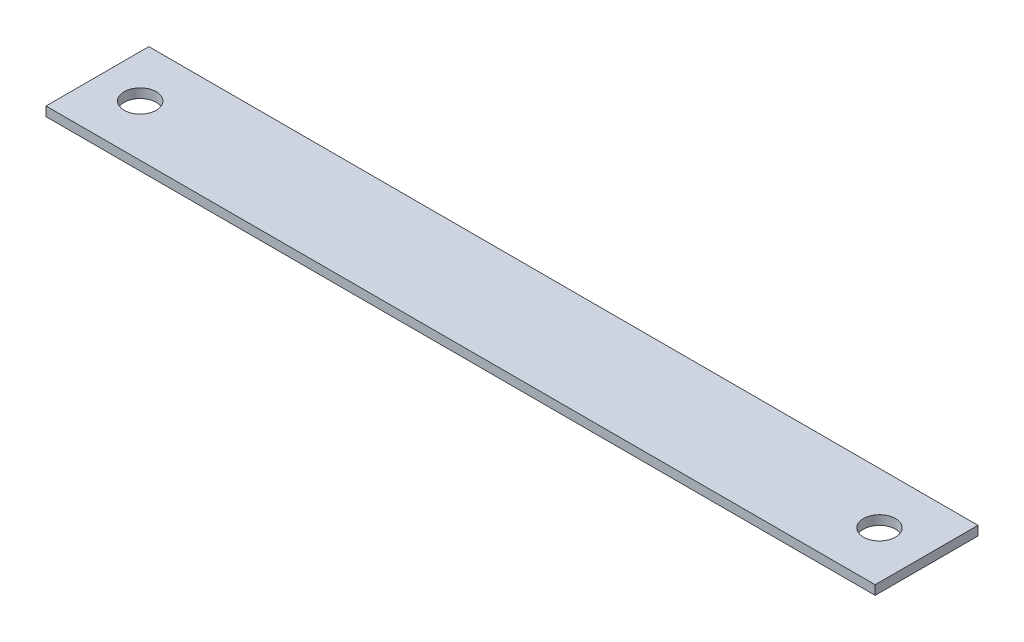
ISO-10303-21;
HEADER;
FILE_DESCRIPTION(('STEP AP214'),'2;1');
FILE_NAME('part.step','',(''),(''),'','','');
FILE_SCHEMA(('AUTOMOTIVE_DESIGN { 1 0 10303 214 1 1 1 1 }'));
ENDSEC;
DATA;
#1=APPLICATION_CONTEXT('core data for automotive mechanical design processes');
#2=APPLICATION_PROTOCOL_DEFINITION('international standard','automotive_design',2000,#1);
#3=PRODUCT_CONTEXT('',#1,'mechanical');
#4=PRODUCT('Part','Part','',(#3));
#5=PRODUCT_RELATED_PRODUCT_CATEGORY('part','',(#4));
#6=PRODUCT_DEFINITION_FORMATION('','',#4);
#7=PRODUCT_DEFINITION_CONTEXT('part definition',#1,'design');
#8=PRODUCT_DEFINITION('design','',#6,#7);
#9=PRODUCT_DEFINITION_SHAPE('','',#8);
#10=(LENGTH_UNIT() NAMED_UNIT(*) SI_UNIT(.MILLI.,.METRE.));
#11=(NAMED_UNIT(*) PLANE_ANGLE_UNIT() SI_UNIT($,.RADIAN.));
#12=(NAMED_UNIT(*) SI_UNIT($,.STERADIAN.) SOLID_ANGLE_UNIT());
#13=UNCERTAINTY_MEASURE_WITH_UNIT(LENGTH_MEASURE(1.E-05),#10,'distance_accuracy_value','');
#14=(GEOMETRIC_REPRESENTATION_CONTEXT(3) GLOBAL_UNCERTAINTY_ASSIGNED_CONTEXT((#13)) GLOBAL_UNIT_ASSIGNED_CONTEXT((#10,
#11,#12)) REPRESENTATION_CONTEXT('',''));
#15=CARTESIAN_POINT('',(0.,0.,0.));
#16=DIRECTION('',(0.,0.,1.));
#17=DIRECTION('',(1.,0.,0.));
#18=AXIS2_PLACEMENT_3D('',#15,#16,#17);
#19=CARTESIAN_POINT('',(0.,2.286,0.));
#20=DIRECTION('',(1.,0.,0.));
#21=DIRECTION('',(0.,0.,-1.));
#22=AXIS2_PLACEMENT_3D('',#19,#20,#21);
#23=PLANE('',#22);
#24=DIRECTION('',(0.,0.,1.));
#25=VECTOR('',#24,1.);
#26=CARTESIAN_POINT('',(0.,0.,0.));
#27=LINE('',#26,#25);
#28=CARTESIAN_POINT('',(0.,0.,-25.4));
#29=VERTEX_POINT('',#28);
#30=CARTESIAN_POINT('',(0.,0.,0.));
#31=VERTEX_POINT('',#30);
#32=EDGE_CURVE('E107',#29,#31,#27,.T.);
#33=ORIENTED_EDGE('',*,*,#32,.T.);
#34=DIRECTION('',(0.,-1.,0.));
#35=VECTOR('',#34,1.);
#36=CARTESIAN_POINT('',(0.,2.286,0.));
#37=LINE('',#36,#35);
#38=CARTESIAN_POINT('',(0.,2.286,0.));
#39=VERTEX_POINT('',#38);
#40=EDGE_CURVE('E11',#39,#31,#37,.T.);
#41=ORIENTED_EDGE('',*,*,#40,.F.);
#42=DIRECTION('',(0.,0.,1.));
#43=VECTOR('',#42,1.);
#44=CARTESIAN_POINT('',(0.,2.286,0.));
#45=LINE('',#44,#43);
#46=CARTESIAN_POINT('',(0.,2.286,-25.4));
#47=VERTEX_POINT('',#46);
#48=EDGE_CURVE('E91',#47,#39,#45,.T.);
#49=ORIENTED_EDGE('',*,*,#48,.F.);
#50=DIRECTION('',(0.,-1.,0.));
#51=VECTOR('',#50,1.);
#52=CARTESIAN_POINT('',(0.,2.286,-25.4));
#53=LINE('',#52,#51);
#54=EDGE_CURVE('E103',#47,#29,#53,.T.);
#55=ORIENTED_EDGE('',*,*,#54,.T.);
#56=EDGE_LOOP('',(#33,#41,#49,#55));
#57=FACE_BOUND('',#56,.T.);
#58=ADVANCED_FACE('F39',(#57),#23,.F.);
#59=CARTESIAN_POINT('',(0.,2.286,0.));
#60=DIRECTION('',(0.,0.,-1.));
#61=DIRECTION('',(-1.,0.,0.));
#62=AXIS2_PLACEMENT_3D('',#59,#60,#61);
#63=PLANE('',#62);
#64=DIRECTION('',(1.,0.,0.));
#65=VECTOR('',#64,1.);
#66=CARTESIAN_POINT('',(0.,0.,0.));
#67=LINE('',#66,#65);
#68=CARTESIAN_POINT('',(204.7875,0.,0.));
#69=VERTEX_POINT('',#68);
#70=EDGE_CURVE('E96',#31,#69,#67,.T.);
#71=ORIENTED_EDGE('',*,*,#70,.T.);
#72=DIRECTION('',(0.,-1.,0.));
#73=VECTOR('',#72,1.);
#74=CARTESIAN_POINT('',(204.7875,2.286,0.));
#75=LINE('',#74,#73);
#76=CARTESIAN_POINT('',(204.7875,2.286,0.));
#77=VERTEX_POINT('',#76);
#78=EDGE_CURVE('E48',#77,#69,#75,.T.);
#79=ORIENTED_EDGE('',*,*,#78,.F.);
#80=DIRECTION('',(1.,0.,0.));
#81=VECTOR('',#80,1.);
#82=CARTESIAN_POINT('',(0.,2.286,0.));
#83=LINE('',#82,#81);
#84=EDGE_CURVE('E86',#39,#77,#83,.T.);
#85=ORIENTED_EDGE('',*,*,#84,.F.);
#86=ORIENTED_EDGE('',*,*,#40,.T.);
#87=EDGE_LOOP('',(#71,#79,#85,#86));
#88=FACE_BOUND('',#87,.T.);
#89=ADVANCED_FACE('F95',(#88),#63,.F.);
#90=CARTESIAN_POINT('',(204.7875,2.286,0.));
#91=DIRECTION('',(-1.,0.,0.));
#92=DIRECTION('',(0.,0.,1.));
#93=AXIS2_PLACEMENT_3D('',#90,#91,#92);
#94=PLANE('',#93);
#95=DIRECTION('',(0.,0.,-1.));
#96=VECTOR('',#95,1.);
#97=CARTESIAN_POINT('',(204.7875,0.,0.));
#98=LINE('',#97,#96);
#99=CARTESIAN_POINT('',(204.7875,0.,-25.4));
#100=VERTEX_POINT('',#99);
#101=EDGE_CURVE('E73',#69,#100,#98,.T.);
#102=ORIENTED_EDGE('',*,*,#101,.T.);
#103=DIRECTION('',(0.,-1.,0.));
#104=VECTOR('',#103,1.);
#105=CARTESIAN_POINT('',(204.7875,2.286,-25.4));
#106=LINE('',#105,#104);
#107=CARTESIAN_POINT('',(204.7875,2.286,-25.4));
#108=VERTEX_POINT('',#107);
#109=EDGE_CURVE('E98',#108,#100,#106,.T.);
#110=ORIENTED_EDGE('',*,*,#109,.F.);
#111=DIRECTION('',(0.,0.,-1.));
#112=VECTOR('',#111,1.);
#113=CARTESIAN_POINT('',(204.7875,2.286,0.));
#114=LINE('',#113,#112);
#115=EDGE_CURVE('E89',#77,#108,#114,.T.);
#116=ORIENTED_EDGE('',*,*,#115,.F.);
#117=ORIENTED_EDGE('',*,*,#78,.T.);
#118=EDGE_LOOP('',(#102,#110,#116,#117));
#119=FACE_BOUND('',#118,.T.);
#120=ADVANCED_FACE('F99',(#119),#94,.F.);
#121=CARTESIAN_POINT('',(0.,2.286,-25.4));
#122=DIRECTION('',(0.,0.,1.));
#123=DIRECTION('',(1.,0.,0.));
#124=AXIS2_PLACEMENT_3D('',#121,#122,#123);
#125=PLANE('',#124);
#126=DIRECTION('',(-1.,0.,0.));
#127=VECTOR('',#126,1.);
#128=CARTESIAN_POINT('',(0.,0.,-25.4));
#129=LINE('',#128,#127);
#130=EDGE_CURVE('E79',#100,#29,#129,.T.);
#131=ORIENTED_EDGE('',*,*,#130,.T.);
#132=ORIENTED_EDGE('',*,*,#54,.F.);
#133=DIRECTION('',(-1.,0.,0.));
#134=VECTOR('',#133,1.);
#135=CARTESIAN_POINT('',(0.,2.286,-25.4));
#136=LINE('',#135,#134);
#137=EDGE_CURVE('E56',#108,#47,#136,.T.);
#138=ORIENTED_EDGE('',*,*,#137,.F.);
#139=ORIENTED_EDGE('',*,*,#109,.T.);
#140=EDGE_LOOP('',(#131,#132,#138,#139));
#141=FACE_BOUND('',#140,.T.);
#142=ADVANCED_FACE('F121',(#141),#125,.F.);
#143=CARTESIAN_POINT('',(0.,2.286,0.));
#144=DIRECTION('',(0.,-1.,0.));
#145=DIRECTION('',(0.,0.,-1.));
#146=AXIS2_PLACEMENT_3D('',#143,#144,#145);
#147=PLANE('',#146);
#148=CARTESIAN_POINT('',(10.5664,2.286,-12.7));
#149=DIRECTION('',(0.,1.,0.));
#150=DIRECTION('',(0.,0.,1.));
#151=AXIS2_PLACEMENT_3D('',#148,#149,#150);
#152=CIRCLE('',#151,3.96875);
#153=CARTESIAN_POINT('',(10.5664,2.286,-8.73125));
#154=VERTEX_POINT('',#153);
#155=EDGE_CURVE('E136',#154,#154,#152,.T.);
#156=ORIENTED_EDGE('',*,*,#155,.F.);
#157=EDGE_LOOP('',(#156));
#158=FACE_BOUND('',#157,.T.);
#159=CARTESIAN_POINT('',(193.1543,2.286,-12.7));
#160=DIRECTION('',(0.,1.,0.));
#161=DIRECTION('',(0.,0.,1.));
#162=AXIS2_PLACEMENT_3D('',#159,#160,#161);
#163=CIRCLE('',#162,3.96874999999999);
#164=CARTESIAN_POINT('',(193.1543,2.286,-8.73125000000001));
#165=VERTEX_POINT('',#164);
#166=EDGE_CURVE('E128',#165,#165,#163,.T.);
#167=ORIENTED_EDGE('',*,*,#166,.F.);
#168=EDGE_LOOP('',(#167));
#169=FACE_BOUND('',#168,.T.);
#170=ORIENTED_EDGE('',*,*,#48,.T.);
#171=ORIENTED_EDGE('',*,*,#84,.T.);
#172=ORIENTED_EDGE('',*,*,#115,.T.);
#173=ORIENTED_EDGE('',*,*,#137,.T.);
#174=EDGE_LOOP('',(#170,#171,#172,#173));
#175=FACE_BOUND('',#174,.T.);
#176=ADVANCED_FACE('F87',(#158,#169,#175),#147,.F.);
#177=CARTESIAN_POINT('',(0.,0.,0.));
#178=DIRECTION('',(0.,-1.,0.));
#179=DIRECTION('',(0.,0.,-1.));
#180=AXIS2_PLACEMENT_3D('',#177,#178,#179);
#181=PLANE('',#180);
#182=CARTESIAN_POINT('',(10.5664,0.,-12.7));
#183=DIRECTION('',(0.,1.,0.));
#184=DIRECTION('',(0.,0.,1.));
#185=AXIS2_PLACEMENT_3D('',#182,#183,#184);
#186=CIRCLE('',#185,3.96875);
#187=CARTESIAN_POINT('',(10.5664,0.,-8.73125));
#188=VERTEX_POINT('',#187);
#189=EDGE_CURVE('E111',#188,#188,#186,.T.);
#190=ORIENTED_EDGE('',*,*,#189,.T.);
#191=EDGE_LOOP('',(#190));
#192=FACE_BOUND('',#191,.T.);
#193=CARTESIAN_POINT('',(193.1543,0.,-12.7));
#194=DIRECTION('',(0.,1.,0.));
#195=DIRECTION('',(0.,0.,1.));
#196=AXIS2_PLACEMENT_3D('',#193,#194,#195);
#197=CIRCLE('',#196,3.96874999999999);
#198=CARTESIAN_POINT('',(193.1543,0.,-8.73125000000001));
#199=VERTEX_POINT('',#198);
#200=EDGE_CURVE('E132',#199,#199,#197,.T.);
#201=ORIENTED_EDGE('',*,*,#200,.T.);
#202=EDGE_LOOP('',(#201));
#203=FACE_BOUND('',#202,.T.);
#204=ORIENTED_EDGE('',*,*,#32,.F.);
#205=ORIENTED_EDGE('',*,*,#130,.F.);
#206=ORIENTED_EDGE('',*,*,#101,.F.);
#207=ORIENTED_EDGE('',*,*,#70,.F.);
#208=EDGE_LOOP('',(#204,#205,#206,#207));
#209=FACE_BOUND('',#208,.T.);
#210=ADVANCED_FACE('F124',(#192,#203,#209),#181,.T.);
#211=CARTESIAN_POINT('',(193.1543,0.,-12.7));
#212=DIRECTION('',(0.,1.,0.));
#213=DIRECTION('',(0.,0.,1.));
#214=AXIS2_PLACEMENT_3D('',#211,#212,#213);
#215=CYLINDRICAL_SURFACE('',#214,3.96874999999999);
#216=ORIENTED_EDGE('',*,*,#200,.F.);
#217=EDGE_LOOP('',(#216));
#218=FACE_BOUND('',#217,.T.);
#219=ORIENTED_EDGE('',*,*,#166,.T.);
#220=EDGE_LOOP('',(#219));
#221=FACE_BOUND('',#220,.T.);
#222=ADVANCED_FACE('F149',(#218,#221),#215,.F.);
#223=CARTESIAN_POINT('',(10.5664,0.,-12.7));
#224=DIRECTION('',(0.,1.,0.));
#225=DIRECTION('',(0.,0.,1.));
#226=AXIS2_PLACEMENT_3D('',#223,#224,#225);
#227=CYLINDRICAL_SURFACE('',#226,3.96875);
#228=ORIENTED_EDGE('',*,*,#189,.F.);
#229=EDGE_LOOP('',(#228));
#230=FACE_BOUND('',#229,.T.);
#231=ORIENTED_EDGE('',*,*,#155,.T.);
#232=EDGE_LOOP('',(#231));
#233=FACE_BOUND('',#232,.T.);
#234=ADVANCED_FACE('F146',(#230,#233),#227,.F.);
#235=CLOSED_SHELL('',(#58,#89,#120,#142,#176,#210,#222,#234));
#236=MANIFOLD_SOLID_BREP('B2',#235);
#237=ADVANCED_BREP_SHAPE_REPRESENTATION('',(#18,#236),#14);
#238=SHAPE_DEFINITION_REPRESENTATION(#9,#237);
ENDSEC;
END-ISO-10303-21;
